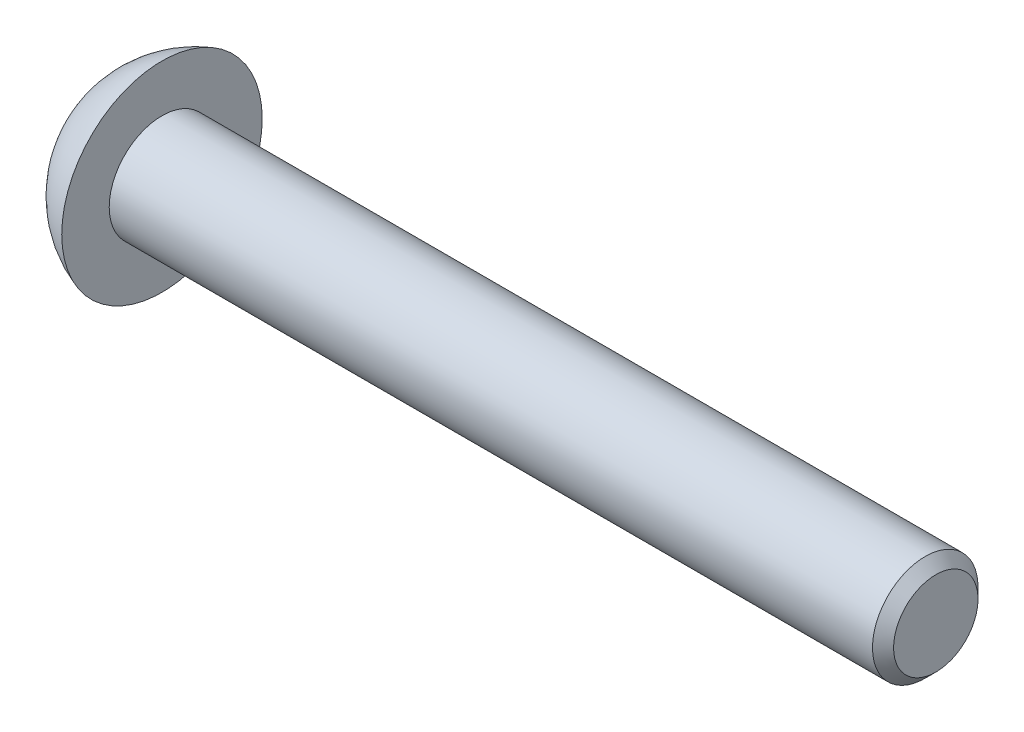
ISO-10303-21;
HEADER;
FILE_DESCRIPTION(('STEP AP214'),'2;1');
FILE_NAME('part.step','',(''),(''),'','','');
FILE_SCHEMA(('AUTOMOTIVE_DESIGN { 1 0 10303 214 1 1 1 1 }'));
ENDSEC;
DATA;
#1=APPLICATION_CONTEXT('core data for automotive mechanical design processes');
#2=APPLICATION_PROTOCOL_DEFINITION('international standard','automotive_design',2000,#1);
#3=PRODUCT_CONTEXT('',#1,'mechanical');
#4=PRODUCT('Part','Part','',(#3));
#5=PRODUCT_RELATED_PRODUCT_CATEGORY('part','',(#4));
#6=PRODUCT_DEFINITION_FORMATION('','',#4);
#7=PRODUCT_DEFINITION_CONTEXT('part definition',#1,'design');
#8=PRODUCT_DEFINITION('design','',#6,#7);
#9=PRODUCT_DEFINITION_SHAPE('','',#8);
#10=(LENGTH_UNIT() NAMED_UNIT(*) SI_UNIT(.MILLI.,.METRE.));
#11=(NAMED_UNIT(*) PLANE_ANGLE_UNIT() SI_UNIT($,.RADIAN.));
#12=(NAMED_UNIT(*) SI_UNIT($,.STERADIAN.) SOLID_ANGLE_UNIT());
#13=UNCERTAINTY_MEASURE_WITH_UNIT(LENGTH_MEASURE(1.E-05),#10,'distance_accuracy_value','');
#14=(GEOMETRIC_REPRESENTATION_CONTEXT(3) GLOBAL_UNCERTAINTY_ASSIGNED_CONTEXT((#13)) GLOBAL_UNIT_ASSIGNED_CONTEXT((#10,
#11,#12)) REPRESENTATION_CONTEXT('',''));
#15=CARTESIAN_POINT('',(0.,0.,0.));
#16=DIRECTION('',(0.,0.,1.));
#17=DIRECTION('',(1.,0.,0.));
#18=AXIS2_PLACEMENT_3D('',#15,#16,#17);
#19=CARTESIAN_POINT('',(0.,0.,-1.5));
#20=DIRECTION('',(-1.,0.,0.));
#21=DIRECTION('',(0.,0.,1.));
#22=AXIS2_PLACEMENT_3D('',#19,#20,#21);
#23=CYLINDRICAL_SURFACE('',#22,1.5);
#24=CARTESIAN_POINT('',(21.7,0.,-1.5));
#25=DIRECTION('',(-1.,0.,0.));
#26=DIRECTION('',(0.,0.,1.));
#27=AXIS2_PLACEMENT_3D('',#24,#25,#26);
#28=CIRCLE('',#27,1.5);
#29=CARTESIAN_POINT('',(21.7,0.,0.));
#30=VERTEX_POINT('',#29);
#31=EDGE_CURVE('E52',#30,#30,#28,.T.);
#32=ORIENTED_EDGE('',*,*,#31,.T.);
#33=EDGE_LOOP('',(#32));
#34=FACE_BOUND('',#33,.T.);
#35=CARTESIAN_POINT('',(0.,0.,-1.5));
#36=DIRECTION('',(-1.,0.,0.));
#37=DIRECTION('',(0.,0.,1.));
#38=AXIS2_PLACEMENT_3D('',#35,#36,#37);
#39=CIRCLE('',#38,1.5);
#40=CARTESIAN_POINT('',(0.,0.,0.));
#41=VERTEX_POINT('',#40);
#42=EDGE_CURVE('E157',#41,#41,#39,.T.);
#43=ORIENTED_EDGE('',*,*,#42,.F.);
#44=EDGE_LOOP('',(#43));
#45=FACE_BOUND('',#44,.T.);
#46=ADVANCED_FACE('F43',(#34,#45),#23,.T.);
#47=CARTESIAN_POINT('',(0.,0.,0.));
#48=DIRECTION('',(-1.,0.,0.));
#49=DIRECTION('',(0.,0.,1.));
#50=AXIS2_PLACEMENT_3D('',#47,#48,#49);
#51=PLANE('',#50);
#52=CARTESIAN_POINT('',(0.,0.,-1.5));
#53=DIRECTION('',(-1.,0.,0.));
#54=DIRECTION('',(0.,0.,1.));
#55=AXIS2_PLACEMENT_3D('',#52,#53,#54);
#56=CIRCLE('',#55,2.85);
#57=CARTESIAN_POINT('',(0.,0.,1.35));
#58=VERTEX_POINT('',#57);
#59=EDGE_CURVE('E154',#58,#58,#56,.T.);
#60=ORIENTED_EDGE('',*,*,#59,.F.);
#61=EDGE_LOOP('',(#60));
#62=FACE_BOUND('',#61,.T.);
#63=ORIENTED_EDGE('',*,*,#42,.T.);
#64=EDGE_LOOP('',(#63));
#65=FACE_BOUND('',#64,.T.);
#66=ADVANCED_FACE('F180',(#62,#65),#51,.F.);
#67=CARTESIAN_POINT('',(0.945547261452463,0.,-1.5));
#68=DIRECTION('',(-1.,0.,0.));
#69=DIRECTION('',(0.,0.,1.));
#70=AXIS2_PLACEMENT_3D('',#67,#68,#69);
#71=DEGENERATE_TOROIDAL_SURFACE('',#70,0.0109977915581003,2.99232236952809,.T.);
#72=CARTESIAN_POINT('',(-1.65,0.,-1.5));
#73=DIRECTION('',(-1.,0.,0.));
#74=DIRECTION('',(0.,0.,1.));
#75=AXIS2_PLACEMENT_3D('',#72,#73,#74);
#76=CIRCLE('',#75,1.5);
#77=CARTESIAN_POINT('',(-1.65,0.,0.));
#78=VERTEX_POINT('',#77);
#79=EDGE_CURVE('E146',#78,#78,#76,.T.);
#80=ORIENTED_EDGE('',*,*,#79,.F.);
#81=EDGE_LOOP('',(#80));
#82=FACE_BOUND('',#81,.T.);
#83=ORIENTED_EDGE('',*,*,#59,.T.);
#84=EDGE_LOOP('',(#83));
#85=FACE_BOUND('',#84,.T.);
#86=ADVANCED_FACE('F185',(#82,#85),#71,.T.);
#87=CARTESIAN_POINT('',(-1.65,0.,0.));
#88=DIRECTION('',(-1.,0.,0.));
#89=DIRECTION('',(0.,0.,1.));
#90=AXIS2_PLACEMENT_3D('',#87,#88,#89);
#91=PLANE('',#90);
#92=DIRECTION('',(0.,0.866025403784439,0.499999999999999));
#93=VECTOR('',#92,1.);
#94=CARTESIAN_POINT('',(-1.65,-1.,-0.922649730810374));
#95=LINE('',#94,#93);
#96=CARTESIAN_POINT('',(-1.65,-1.,-0.922649730810374));
#97=VERTEX_POINT('',#96);
#98=CARTESIAN_POINT('',(-1.65,0.,-0.345299461620748));
#99=VERTEX_POINT('',#98);
#100=EDGE_CURVE('E59',#97,#99,#95,.T.);
#101=ORIENTED_EDGE('',*,*,#100,.F.);
#102=DIRECTION('',(0.,0.,1.));
#103=VECTOR('',#102,1.);
#104=CARTESIAN_POINT('',(-1.65,-1.,-2.07735026918963));
#105=LINE('',#104,#103);
#106=CARTESIAN_POINT('',(-1.65,-1.,-2.07735026918963));
#107=VERTEX_POINT('',#106);
#108=EDGE_CURVE('E142',#107,#97,#105,.T.);
#109=ORIENTED_EDGE('',*,*,#108,.F.);
#110=DIRECTION('',(0.,-0.866025403784439,0.5));
#111=VECTOR('',#110,1.);
#112=CARTESIAN_POINT('',(-1.65,0.,-2.65470053837925));
#113=LINE('',#112,#111);
#114=CARTESIAN_POINT('',(-1.65,0.,-2.65470053837925));
#115=VERTEX_POINT('',#114);
#116=EDGE_CURVE('E140',#115,#107,#113,.T.);
#117=ORIENTED_EDGE('',*,*,#116,.F.);
#118=DIRECTION('',(0.,-0.866025403784439,-0.5));
#119=VECTOR('',#118,1.);
#120=CARTESIAN_POINT('',(-1.65,1.,-2.07735026918963));
#121=LINE('',#120,#119);
#122=CARTESIAN_POINT('',(-1.65,1.,-2.07735026918963));
#123=VERTEX_POINT('',#122);
#124=EDGE_CURVE('E107',#123,#115,#121,.T.);
#125=ORIENTED_EDGE('',*,*,#124,.F.);
#126=DIRECTION('',(0.,0.,-1.));
#127=VECTOR('',#126,1.);
#128=CARTESIAN_POINT('',(-1.65,1.,-0.922649730810374));
#129=LINE('',#128,#127);
#130=CARTESIAN_POINT('',(-1.65,1.,-0.922649730810374));
#131=VERTEX_POINT('',#130);
#132=EDGE_CURVE('E136',#131,#123,#129,.T.);
#133=ORIENTED_EDGE('',*,*,#132,.F.);
#134=DIRECTION('',(0.,0.866025403784439,-0.5));
#135=VECTOR('',#134,1.);
#136=CARTESIAN_POINT('',(-1.65,0.,-0.345299461620748));
#137=LINE('',#136,#135);
#138=EDGE_CURVE('E133',#99,#131,#137,.T.);
#139=ORIENTED_EDGE('',*,*,#138,.F.);
#140=EDGE_LOOP('',(#101,#109,#117,#125,#133,#139));
#141=FACE_BOUND('',#140,.T.);
#142=ORIENTED_EDGE('',*,*,#79,.T.);
#143=EDGE_LOOP('',(#142));
#144=FACE_BOUND('',#143,.T.);
#145=ADVANCED_FACE('F175',(#141,#144),#91,.T.);
#146=CARTESIAN_POINT('',(22.,0.,0.));
#147=DIRECTION('',(-1.,0.,0.));
#148=DIRECTION('',(0.,0.,1.));
#149=AXIS2_PLACEMENT_3D('',#146,#147,#148);
#150=PLANE('',#149);
#151=CARTESIAN_POINT('',(22.,0.,-1.5));
#152=DIRECTION('',(-1.,0.,0.));
#153=DIRECTION('',(0.,0.,1.));
#154=AXIS2_PLACEMENT_3D('',#151,#152,#153);
#155=CIRCLE('',#154,1.2);
#156=CARTESIAN_POINT('',(22.,0.,-0.3));
#157=VERTEX_POINT('',#156);
#158=EDGE_CURVE('E11',#157,#157,#155,.F.);
#159=ORIENTED_EDGE('',*,*,#158,.T.);
#160=EDGE_LOOP('',(#159));
#161=FACE_BOUND('',#160,.T.);
#162=ADVANCED_FACE('F166',(#161),#150,.F.);
#163=CARTESIAN_POINT('',(21.7,0.,-1.5));
#164=DIRECTION('',(-1.,0.,0.));
#165=DIRECTION('',(0.,0.,1.));
#166=AXIS2_PLACEMENT_3D('',#163,#164,#165);
#167=CONICAL_SURFACE('',#166,1.5,0.785398163397445);
#168=ORIENTED_EDGE('',*,*,#158,.F.);
#169=EDGE_LOOP('',(#168));
#170=FACE_BOUND('',#169,.T.);
#171=ORIENTED_EDGE('',*,*,#31,.F.);
#172=EDGE_LOOP('',(#171));
#173=FACE_BOUND('',#172,.T.);
#174=ADVANCED_FACE('F46',(#170,#173),#167,.T.);
#175=CARTESIAN_POINT('',(-0.45,-1.,-0.922649730810374));
#176=DIRECTION('',(0.,-0.5,0.866025403784439));
#177=DIRECTION('',(0.,-0.866025403784439,-0.5));
#178=AXIS2_PLACEMENT_3D('',#175,#176,#177);
#179=PLANE('',#178);
#180=ORIENTED_EDGE('',*,*,#100,.T.);
#181=DIRECTION('',(-1.,0.,0.));
#182=VECTOR('',#181,1.);
#183=CARTESIAN_POINT('',(-0.45,0.,-0.345299461620748));
#184=LINE('',#183,#182);
#185=CARTESIAN_POINT('',(-0.45,0.,-0.345299461620748));
#186=VERTEX_POINT('',#185);
#187=EDGE_CURVE('E89',#186,#99,#184,.T.);
#188=ORIENTED_EDGE('',*,*,#187,.F.);
#189=DIRECTION('',(0.,0.866025403784439,0.499999999999999));
#190=VECTOR('',#189,1.);
#191=CARTESIAN_POINT('',(-0.45,-1.,-0.922649730810374));
#192=LINE('',#191,#190);
#193=CARTESIAN_POINT('',(-0.45,-1.,-0.922649730810374));
#194=VERTEX_POINT('',#193);
#195=EDGE_CURVE('E144',#194,#186,#192,.T.);
#196=ORIENTED_EDGE('',*,*,#195,.F.);
#197=DIRECTION('',(-1.,0.,0.));
#198=VECTOR('',#197,1.);
#199=CARTESIAN_POINT('',(-0.45,-1.,-0.922649730810374));
#200=LINE('',#199,#198);
#201=EDGE_CURVE('E67',#194,#97,#200,.T.);
#202=ORIENTED_EDGE('',*,*,#201,.T.);
#203=EDGE_LOOP('',(#180,#188,#196,#202));
#204=FACE_BOUND('',#203,.T.);
#205=ADVANCED_FACE('F165',(#204),#179,.F.);
#206=CARTESIAN_POINT('',(-0.45,-1.,-2.07735026918963));
#207=DIRECTION('',(0.,-1.,0.));
#208=DIRECTION('',(0.,0.,-1.));
#209=AXIS2_PLACEMENT_3D('',#206,#207,#208);
#210=PLANE('',#209);
#211=ORIENTED_EDGE('',*,*,#108,.T.);
#212=ORIENTED_EDGE('',*,*,#201,.F.);
#213=DIRECTION('',(0.,0.,1.));
#214=VECTOR('',#213,1.);
#215=CARTESIAN_POINT('',(-0.45,-1.,-2.07735026918963));
#216=LINE('',#215,#214);
#217=CARTESIAN_POINT('',(-0.45,-1.,-2.07735026918963));
#218=VERTEX_POINT('',#217);
#219=EDGE_CURVE('E119',#218,#194,#216,.T.);
#220=ORIENTED_EDGE('',*,*,#219,.F.);
#221=DIRECTION('',(-1.,0.,0.));
#222=VECTOR('',#221,1.);
#223=CARTESIAN_POINT('',(-0.45,-1.,-2.07735026918963));
#224=LINE('',#223,#222);
#225=EDGE_CURVE('E111',#218,#107,#224,.T.);
#226=ORIENTED_EDGE('',*,*,#225,.T.);
#227=EDGE_LOOP('',(#211,#212,#220,#226));
#228=FACE_BOUND('',#227,.T.);
#229=ADVANCED_FACE('F173',(#228),#210,.F.);
#230=CARTESIAN_POINT('',(-0.45,0.,-2.65470053837925));
#231=DIRECTION('',(0.,-0.5,-0.866025403784439));
#232=DIRECTION('',(0.,0.866025403784439,-0.5));
#233=AXIS2_PLACEMENT_3D('',#230,#231,#232);
#234=PLANE('',#233);
#235=ORIENTED_EDGE('',*,*,#116,.T.);
#236=ORIENTED_EDGE('',*,*,#225,.F.);
#237=DIRECTION('',(0.,-0.866025403784439,0.5));
#238=VECTOR('',#237,1.);
#239=CARTESIAN_POINT('',(-0.45,0.,-2.65470053837925));
#240=LINE('',#239,#238);
#241=CARTESIAN_POINT('',(-0.45,0.,-2.65470053837925));
#242=VERTEX_POINT('',#241);
#243=EDGE_CURVE('E115',#242,#218,#240,.T.);
#244=ORIENTED_EDGE('',*,*,#243,.F.);
#245=DIRECTION('',(-1.,0.,0.));
#246=VECTOR('',#245,1.);
#247=CARTESIAN_POINT('',(-0.45,0.,-2.65470053837925));
#248=LINE('',#247,#246);
#249=EDGE_CURVE('E100',#242,#115,#248,.T.);
#250=ORIENTED_EDGE('',*,*,#249,.T.);
#251=EDGE_LOOP('',(#235,#236,#244,#250));
#252=FACE_BOUND('',#251,.T.);
#253=ADVANCED_FACE('F116',(#252),#234,.F.);
#254=CARTESIAN_POINT('',(-0.45,1.,-2.07735026918963));
#255=DIRECTION('',(0.,0.5,-0.866025403784439));
#256=DIRECTION('',(0.,0.866025403784439,0.5));
#257=AXIS2_PLACEMENT_3D('',#254,#255,#256);
#258=PLANE('',#257);
#259=ORIENTED_EDGE('',*,*,#124,.T.);
#260=ORIENTED_EDGE('',*,*,#249,.F.);
#261=DIRECTION('',(0.,-0.866025403784439,-0.5));
#262=VECTOR('',#261,1.);
#263=CARTESIAN_POINT('',(-0.45,1.,-2.07735026918963));
#264=LINE('',#263,#262);
#265=CARTESIAN_POINT('',(-0.45,1.,-2.07735026918963));
#266=VERTEX_POINT('',#265);
#267=EDGE_CURVE('E104',#266,#242,#264,.T.);
#268=ORIENTED_EDGE('',*,*,#267,.F.);
#269=DIRECTION('',(-1.,0.,0.));
#270=VECTOR('',#269,1.);
#271=CARTESIAN_POINT('',(-0.45,1.,-2.07735026918963));
#272=LINE('',#271,#270);
#273=EDGE_CURVE('E112',#266,#123,#272,.T.);
#274=ORIENTED_EDGE('',*,*,#273,.T.);
#275=EDGE_LOOP('',(#259,#260,#268,#274));
#276=FACE_BOUND('',#275,.T.);
#277=ADVANCED_FACE('F102',(#276),#258,.F.);
#278=CARTESIAN_POINT('',(-0.45,1.,-0.922649730810374));
#279=DIRECTION('',(0.,1.,0.));
#280=DIRECTION('',(0.,0.,1.));
#281=AXIS2_PLACEMENT_3D('',#278,#279,#280);
#282=PLANE('',#281);
#283=ORIENTED_EDGE('',*,*,#132,.T.);
#284=ORIENTED_EDGE('',*,*,#273,.F.);
#285=DIRECTION('',(0.,0.,-1.));
#286=VECTOR('',#285,1.);
#287=CARTESIAN_POINT('',(-0.45,1.,-0.922649730810374));
#288=LINE('',#287,#286);
#289=CARTESIAN_POINT('',(-0.45,1.,-0.922649730810374));
#290=VERTEX_POINT('',#289);
#291=EDGE_CURVE('E125',#290,#266,#288,.T.);
#292=ORIENTED_EDGE('',*,*,#291,.F.);
#293=DIRECTION('',(-1.,0.,0.));
#294=VECTOR('',#293,1.);
#295=CARTESIAN_POINT('',(-0.45,1.,-0.922649730810374));
#296=LINE('',#295,#294);
#297=EDGE_CURVE('E149',#290,#131,#296,.T.);
#298=ORIENTED_EDGE('',*,*,#297,.T.);
#299=EDGE_LOOP('',(#283,#284,#292,#298));
#300=FACE_BOUND('',#299,.T.);
#301=ADVANCED_FACE('F196',(#300),#282,.F.);
#302=CARTESIAN_POINT('',(-0.45,0.,-0.345299461620748));
#303=DIRECTION('',(0.,0.5,0.866025403784439));
#304=DIRECTION('',(0.,-0.866025403784439,0.5));
#305=AXIS2_PLACEMENT_3D('',#302,#303,#304);
#306=PLANE('',#305);
#307=ORIENTED_EDGE('',*,*,#138,.T.);
#308=ORIENTED_EDGE('',*,*,#297,.F.);
#309=DIRECTION('',(0.,0.866025403784439,-0.5));
#310=VECTOR('',#309,1.);
#311=CARTESIAN_POINT('',(-0.45,0.,-0.345299461620748));
#312=LINE('',#311,#310);
#313=EDGE_CURVE('E127',#186,#290,#312,.T.);
#314=ORIENTED_EDGE('',*,*,#313,.F.);
#315=ORIENTED_EDGE('',*,*,#187,.T.);
#316=EDGE_LOOP('',(#307,#308,#314,#315));
#317=FACE_BOUND('',#316,.T.);
#318=ADVANCED_FACE('F193',(#317),#306,.F.);
#319=CARTESIAN_POINT('',(-0.45,0.,0.));
#320=DIRECTION('',(-1.,0.,0.));
#321=DIRECTION('',(0.,0.,1.));
#322=AXIS2_PLACEMENT_3D('',#319,#320,#321);
#323=PLANE('',#322);
#324=ORIENTED_EDGE('',*,*,#195,.T.);
#325=ORIENTED_EDGE('',*,*,#313,.T.);
#326=ORIENTED_EDGE('',*,*,#291,.T.);
#327=ORIENTED_EDGE('',*,*,#267,.T.);
#328=ORIENTED_EDGE('',*,*,#243,.T.);
#329=ORIENTED_EDGE('',*,*,#219,.T.);
#330=EDGE_LOOP('',(#324,#325,#326,#327,#328,#329));
#331=FACE_BOUND('',#330,.T.);
#332=ADVANCED_FACE('F122',(#331),#323,.T.);
#333=CLOSED_SHELL('',(#46,#66,#86,#145,#162,#174,#205,#229,#253,#277,#301,#318,#332));
#334=MANIFOLD_SOLID_BREP('B2',#333);
#335=ADVANCED_BREP_SHAPE_REPRESENTATION('',(#18,#334),#14);
#336=SHAPE_DEFINITION_REPRESENTATION(#9,#335);
ENDSEC;
END-ISO-10303-21;
